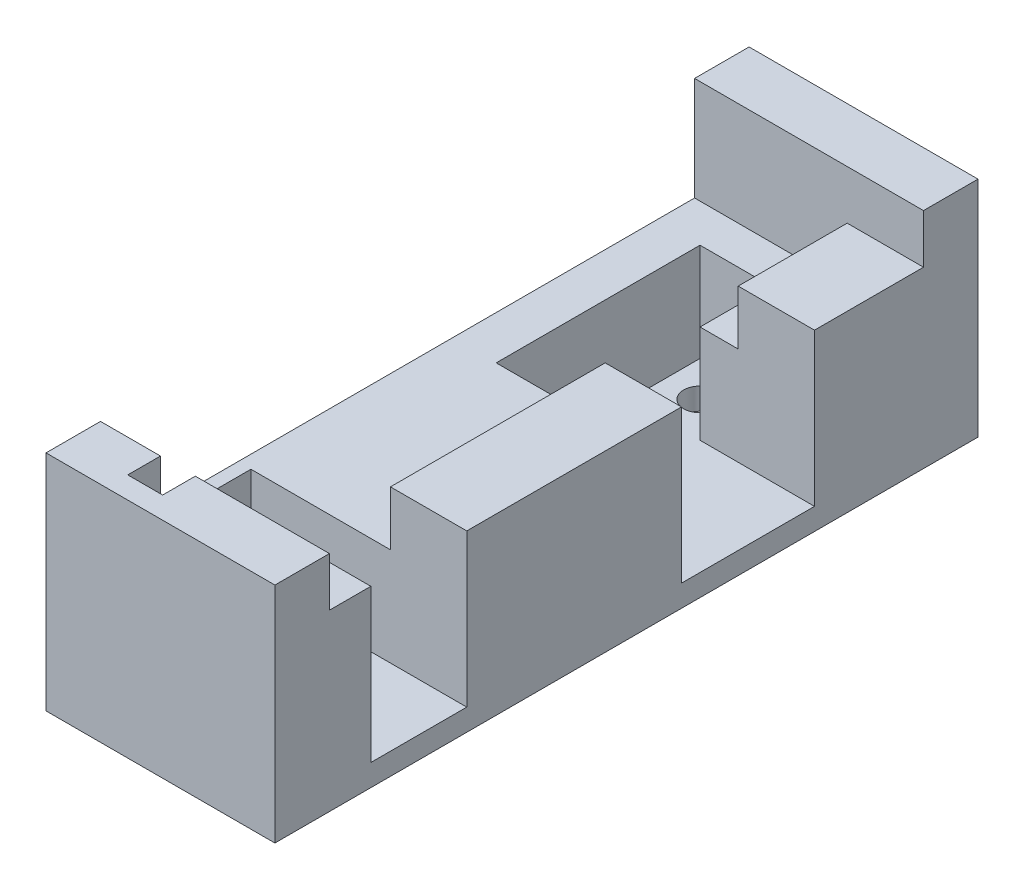
ISO-10303-21;
HEADER;
FILE_DESCRIPTION(('STEP AP214'),'2;1');
FILE_NAME('part.step','',(''),(''),'','','');
FILE_SCHEMA(('AUTOMOTIVE_DESIGN { 1 0 10303 214 1 1 1 1 }'));
ENDSEC;
DATA;
#1=APPLICATION_CONTEXT('core data for automotive mechanical design processes');
#2=APPLICATION_PROTOCOL_DEFINITION('international standard','automotive_design',2000,#1);
#3=PRODUCT_CONTEXT('',#1,'mechanical');
#4=PRODUCT('Part','Part','',(#3));
#5=PRODUCT_RELATED_PRODUCT_CATEGORY('part','',(#4));
#6=PRODUCT_DEFINITION_FORMATION('','',#4);
#7=PRODUCT_DEFINITION_CONTEXT('part definition',#1,'design');
#8=PRODUCT_DEFINITION('design','',#6,#7);
#9=PRODUCT_DEFINITION_SHAPE('','',#8);
#10=(LENGTH_UNIT() NAMED_UNIT(*) SI_UNIT(.MILLI.,.METRE.));
#11=(NAMED_UNIT(*) PLANE_ANGLE_UNIT() SI_UNIT($,.RADIAN.));
#12=(NAMED_UNIT(*) SI_UNIT($,.STERADIAN.) SOLID_ANGLE_UNIT());
#13=UNCERTAINTY_MEASURE_WITH_UNIT(LENGTH_MEASURE(1.E-05),#10,'distance_accuracy_value','');
#14=(GEOMETRIC_REPRESENTATION_CONTEXT(3) GLOBAL_UNCERTAINTY_ASSIGNED_CONTEXT((#13)) GLOBAL_UNIT_ASSIGNED_CONTEXT((#10,
#11,#12)) REPRESENTATION_CONTEXT('',''));
#15=CARTESIAN_POINT('',(0.,0.,0.));
#16=DIRECTION('',(0.,0.,1.));
#17=DIRECTION('',(1.,0.,0.));
#18=AXIS2_PLACEMENT_3D('',#15,#16,#17);
#19=CARTESIAN_POINT('',(-12.3,0.,59.5));
#20=DIRECTION('',(-1.,0.,0.));
#21=DIRECTION('',(0.,0.,1.));
#22=AXIS2_PLACEMENT_3D('',#19,#20,#21);
#23=PLANE('',#22);
#24=DIRECTION('',(0.,0.,-1.));
#25=VECTOR('',#24,1.);
#26=CARTESIAN_POINT('',(-12.3,14.,59.5));
#27=LINE('',#26,#25);
#28=CARTESIAN_POINT('',(-12.3,14.,57.5));
#29=VERTEX_POINT('',#28);
#30=CARTESIAN_POINT('',(-12.3,14.,54.5));
#31=VERTEX_POINT('',#30);
#32=EDGE_CURVE('E253',#29,#31,#27,.T.);
#33=ORIENTED_EDGE('',*,*,#32,.F.);
#34=DIRECTION('',(0.,-1.,0.));
#35=VECTOR('',#34,1.);
#36=CARTESIAN_POINT('',(-12.3,18.5,57.5));
#37=LINE('',#36,#35);
#38=CARTESIAN_POINT('',(-12.3,18.5,57.5));
#39=VERTEX_POINT('',#38);
#40=EDGE_CURVE('E504',#39,#29,#37,.T.);
#41=ORIENTED_EDGE('',*,*,#40,.F.);
#42=DIRECTION('',(0.,0.,-1.));
#43=VECTOR('',#42,1.);
#44=CARTESIAN_POINT('',(-12.3,18.5,59.5));
#45=LINE('',#44,#43);
#46=CARTESIAN_POINT('',(-12.3,18.5,54.5));
#47=VERTEX_POINT('',#46);
#48=EDGE_CURVE('E240',#39,#47,#45,.T.);
#49=ORIENTED_EDGE('',*,*,#48,.T.);
#50=DIRECTION('',(0.,1.,0.));
#51=VECTOR('',#50,1.);
#52=CARTESIAN_POINT('',(-12.3,0.,54.5));
#53=LINE('',#52,#51);
#54=EDGE_CURVE('E537',#31,#47,#53,.T.);
#55=ORIENTED_EDGE('',*,*,#54,.F.);
#56=EDGE_LOOP('',(#33,#41,#49,#55));
#57=FACE_BOUND('',#56,.T.);
#58=ADVANCED_FACE('F41',(#57),#23,.T.);
#59=CARTESIAN_POINT('',(0.,14.,59.5));
#60=DIRECTION('',(0.,-1.,0.));
#61=DIRECTION('',(0.,0.,-1.));
#62=AXIS2_PLACEMENT_3D('',#59,#60,#61);
#63=PLANE('',#62);
#64=DIRECTION('',(1.,0.,0.));
#65=VECTOR('',#64,1.);
#66=CARTESIAN_POINT('',(-21.002,14.,57.5));
#67=LINE('',#66,#65);
#68=CARTESIAN_POINT('',(-15.5,14.,57.5));
#69=VERTEX_POINT('',#68);
#70=EDGE_CURVE('E228',#69,#29,#67,.T.);
#71=ORIENTED_EDGE('',*,*,#70,.T.);
#72=ORIENTED_EDGE('',*,*,#32,.T.);
#73=DIRECTION('',(-1.,0.,0.));
#74=VECTOR('',#73,1.);
#75=CARTESIAN_POINT('',(0.,14.,54.5));
#76=LINE('',#75,#74);
#77=CARTESIAN_POINT('',(-15.5,14.,54.5));
#78=VERTEX_POINT('',#77);
#79=EDGE_CURVE('E542',#31,#78,#76,.T.);
#80=ORIENTED_EDGE('',*,*,#79,.T.);
#81=DIRECTION('',(0.,0.,-1.));
#82=VECTOR('',#81,1.);
#83=CARTESIAN_POINT('',(-15.5,14.,59.5));
#84=LINE('',#83,#82);
#85=EDGE_CURVE('E248',#69,#78,#84,.T.);
#86=ORIENTED_EDGE('',*,*,#85,.F.);
#87=EDGE_LOOP('',(#71,#72,#80,#86));
#88=FACE_BOUND('',#87,.T.);
#89=ADVANCED_FACE('F624',(#88),#63,.F.);
#90=CARTESIAN_POINT('',(-15.5,0.,59.5));
#91=DIRECTION('',(-1.,0.,0.));
#92=DIRECTION('',(0.,0.,1.));
#93=AXIS2_PLACEMENT_3D('',#90,#91,#92);
#94=PLANE('',#93);
#95=DIRECTION('',(0.,-1.,0.));
#96=VECTOR('',#95,1.);
#97=CARTESIAN_POINT('',(-15.5,18.5,57.5));
#98=LINE('',#97,#96);
#99=CARTESIAN_POINT('',(-15.5,18.5,57.5));
#100=VERTEX_POINT('',#99);
#101=EDGE_CURVE('E222',#100,#69,#98,.T.);
#102=ORIENTED_EDGE('',*,*,#101,.T.);
#103=ORIENTED_EDGE('',*,*,#85,.T.);
#104=DIRECTION('',(0.,1.,0.));
#105=VECTOR('',#104,1.);
#106=CARTESIAN_POINT('',(-15.5,0.,54.5));
#107=LINE('',#106,#105);
#108=CARTESIAN_POINT('',(-15.5,18.5,54.5));
#109=VERTEX_POINT('',#108);
#110=EDGE_CURVE('E245',#78,#109,#107,.T.);
#111=ORIENTED_EDGE('',*,*,#110,.T.);
#112=DIRECTION('',(0.,0.,-1.));
#113=VECTOR('',#112,1.);
#114=CARTESIAN_POINT('',(-15.5,18.5,59.5));
#115=LINE('',#114,#113);
#116=EDGE_CURVE('E238',#100,#109,#115,.T.);
#117=ORIENTED_EDGE('',*,*,#116,.F.);
#118=EDGE_LOOP('',(#102,#103,#111,#117));
#119=FACE_BOUND('',#118,.T.);
#120=ADVANCED_FACE('F243',(#119),#94,.F.);
#121=CARTESIAN_POINT('',(-21.,14.,0.));
#122=DIRECTION('',(1.,0.,0.));
#123=DIRECTION('',(0.,0.,-1.));
#124=AXIS2_PLACEMENT_3D('',#121,#122,#123);
#125=PLANE('',#124);
#126=DIRECTION('',(0.,0.,1.));
#127=VECTOR('',#126,1.);
#128=CARTESIAN_POINT('',(-21.,9.,0.));
#129=LINE('',#128,#127);
#130=CARTESIAN_POINT('',(-21.,9.,0.));
#131=VERTEX_POINT('',#130);
#132=CARTESIAN_POINT('',(-21.,9.,54.5));
#133=VERTEX_POINT('',#132);
#134=EDGE_CURVE('E269',#131,#133,#129,.T.);
#135=ORIENTED_EDGE('',*,*,#134,.F.);
#136=DIRECTION('',(0.,1.,0.));
#137=VECTOR('',#136,1.);
#138=CARTESIAN_POINT('',(-21.,-2.,0.));
#139=LINE('',#138,#137);
#140=CARTESIAN_POINT('',(-21.,18.5,0.));
#141=VERTEX_POINT('',#140);
#142=EDGE_CURVE('E492',#131,#141,#139,.T.);
#143=ORIENTED_EDGE('',*,*,#142,.T.);
#144=DIRECTION('',(0.,0.,1.));
#145=VECTOR('',#144,1.);
#146=CARTESIAN_POINT('',(-21.,18.5,-5.));
#147=LINE('',#146,#145);
#148=CARTESIAN_POINT('',(-21.,18.5,-5.));
#149=VERTEX_POINT('',#148);
#150=EDGE_CURVE('E512',#149,#141,#147,.T.);
#151=ORIENTED_EDGE('',*,*,#150,.F.);
#152=DIRECTION('',(0.,1.,0.));
#153=VECTOR('',#152,1.);
#154=CARTESIAN_POINT('',(-21.,-2.,-5.));
#155=LINE('',#154,#153);
#156=CARTESIAN_POINT('',(-21.,-2.,-5.));
#157=VERTEX_POINT('',#156);
#158=EDGE_CURVE('E593',#157,#149,#155,.T.);
#159=ORIENTED_EDGE('',*,*,#158,.F.);
#160=DIRECTION('',(0.,0.,1.));
#161=VECTOR('',#160,1.);
#162=CARTESIAN_POINT('',(-21.,-2.,0.));
#163=LINE('',#162,#161);
#164=CARTESIAN_POINT('',(-21.,-2.,59.5));
#165=VERTEX_POINT('',#164);
#166=EDGE_CURVE('E342',#157,#165,#163,.T.);
#167=ORIENTED_EDGE('',*,*,#166,.T.);
#168=DIRECTION('',(0.,-1.,0.));
#169=VECTOR('',#168,1.);
#170=CARTESIAN_POINT('',(-21.,0.,59.5));
#171=LINE('',#170,#169);
#172=CARTESIAN_POINT('',(-21.,18.5,59.5));
#173=VERTEX_POINT('',#172);
#174=EDGE_CURVE('E525',#173,#165,#171,.T.);
#175=ORIENTED_EDGE('',*,*,#174,.F.);
#176=DIRECTION('',(0.,0.,-1.));
#177=VECTOR('',#176,1.);
#178=CARTESIAN_POINT('',(-21.,18.5,59.5));
#179=LINE('',#178,#177);
#180=CARTESIAN_POINT('',(-21.,18.5,54.5));
#181=VERTEX_POINT('',#180);
#182=EDGE_CURVE('E249',#173,#181,#179,.T.);
#183=ORIENTED_EDGE('',*,*,#182,.T.);
#184=DIRECTION('',(0.,-1.,0.));
#185=VECTOR('',#184,1.);
#186=CARTESIAN_POINT('',(-21.,0.,54.5));
#187=LINE('',#186,#185);
#188=EDGE_CURVE('E522',#181,#133,#187,.T.);
#189=ORIENTED_EDGE('',*,*,#188,.T.);
#190=EDGE_LOOP('',(#135,#143,#151,#159,#167,#175,#183,#189));
#191=FACE_BOUND('',#190,.T.);
#192=ADVANCED_FACE('F43',(#191),#125,.F.);
#193=CARTESIAN_POINT('',(-19.8,14.,41.9));
#194=DIRECTION('',(-1.,0.,0.));
#195=DIRECTION('',(0.,0.,1.));
#196=AXIS2_PLACEMENT_3D('',#193,#194,#195);
#197=PLANE('',#196);
#198=DIRECTION('',(0.,0.,-1.));
#199=VECTOR('',#198,1.);
#200=CARTESIAN_POINT('',(-19.8,9.,41.9));
#201=LINE('',#200,#199);
#202=CARTESIAN_POINT('',(-19.8,9.,50.7));
#203=VERTEX_POINT('',#202);
#204=CARTESIAN_POINT('',(-19.8,9.,41.9));
#205=VERTEX_POINT('',#204);
#206=EDGE_CURVE('E327',#203,#205,#201,.T.);
#207=ORIENTED_EDGE('',*,*,#206,.F.);
#208=DIRECTION('',(0.,-1.,0.));
#209=VECTOR('',#208,1.);
#210=CARTESIAN_POINT('',(-19.8,14.,50.7));
#211=LINE('',#210,#209);
#212=CARTESIAN_POINT('',(-19.8,0.,50.7));
#213=VERTEX_POINT('',#212);
#214=EDGE_CURVE('E440',#203,#213,#211,.T.);
#215=ORIENTED_EDGE('',*,*,#214,.T.);
#216=DIRECTION('',(0.,0.,-1.));
#217=VECTOR('',#216,1.);
#218=CARTESIAN_POINT('',(-19.8,0.,41.9));
#219=LINE('',#218,#217);
#220=CARTESIAN_POINT('',(-19.8,0.,41.9));
#221=VERTEX_POINT('',#220);
#222=EDGE_CURVE('E387',#213,#221,#219,.T.);
#223=ORIENTED_EDGE('',*,*,#222,.T.);
#224=DIRECTION('',(0.,-1.,0.));
#225=VECTOR('',#224,1.);
#226=CARTESIAN_POINT('',(-19.8,14.,41.9));
#227=LINE('',#226,#225);
#228=EDGE_CURVE('E437',#205,#221,#227,.T.);
#229=ORIENTED_EDGE('',*,*,#228,.F.);
#230=EDGE_LOOP('',(#207,#215,#223,#229));
#231=FACE_BOUND('',#230,.T.);
#232=ADVANCED_FACE('F565',(#231),#197,.F.);
#233=CARTESIAN_POINT('',(-17.,14.,10.));
#234=DIRECTION('',(-1.,0.,0.));
#235=DIRECTION('',(0.,0.,1.));
#236=AXIS2_PLACEMENT_3D('',#233,#234,#235);
#237=PLANE('',#236);
#238=DIRECTION('',(0.,0.,-1.));
#239=VECTOR('',#238,1.);
#240=CARTESIAN_POINT('',(-17.,9.,10.));
#241=LINE('',#240,#239);
#242=CARTESIAN_POINT('',(-17.,9.,22.2));
#243=VERTEX_POINT('',#242);
#244=CARTESIAN_POINT('',(-17.,9.,3.5));
#245=VERTEX_POINT('',#244);
#246=EDGE_CURVE('E318',#243,#245,#241,.T.);
#247=ORIENTED_EDGE('',*,*,#246,.F.);
#248=DIRECTION('',(0.,-1.,0.));
#249=VECTOR('',#248,1.);
#250=CARTESIAN_POINT('',(-17.,14.,22.2));
#251=LINE('',#250,#249);
#252=CARTESIAN_POINT('',(-17.,0.,22.2));
#253=VERTEX_POINT('',#252);
#254=EDGE_CURVE('E426',#243,#253,#251,.T.);
#255=ORIENTED_EDGE('',*,*,#254,.T.);
#256=DIRECTION('',(0.,0.,-1.));
#257=VECTOR('',#256,1.);
#258=CARTESIAN_POINT('',(-17.,0.,10.));
#259=LINE('',#258,#257);
#260=CARTESIAN_POINT('',(-17.,0.,3.5));
#261=VERTEX_POINT('',#260);
#262=EDGE_CURVE('E399',#253,#261,#259,.T.);
#263=ORIENTED_EDGE('',*,*,#262,.T.);
#264=DIRECTION('',(0.,-1.,0.));
#265=VECTOR('',#264,1.);
#266=CARTESIAN_POINT('',(-17.,14.,3.5));
#267=LINE('',#266,#265);
#268=EDGE_CURVE('E423',#245,#261,#267,.T.);
#269=ORIENTED_EDGE('',*,*,#268,.F.);
#270=EDGE_LOOP('',(#247,#255,#263,#269));
#271=FACE_BOUND('',#270,.T.);
#272=ADVANCED_FACE('F665',(#271),#237,.F.);
#273=CARTESIAN_POINT('',(-17.,14.,3.5));
#274=DIRECTION('',(0.,0.,-1.));
#275=DIRECTION('',(-1.,0.,0.));
#276=AXIS2_PLACEMENT_3D('',#273,#274,#275);
#277=PLANE('',#276);
#278=DIRECTION('',(1.,0.,0.));
#279=VECTOR('',#278,1.);
#280=CARTESIAN_POINT('',(-17.,9.,3.5));
#281=LINE('',#280,#279);
#282=CARTESIAN_POINT('',(-10.5,9.,3.5));
#283=VERTEX_POINT('',#282);
#284=EDGE_CURVE('E315',#245,#283,#281,.T.);
#285=ORIENTED_EDGE('',*,*,#284,.F.);
#286=ORIENTED_EDGE('',*,*,#268,.T.);
#287=DIRECTION('',(1.,0.,0.));
#288=VECTOR('',#287,1.);
#289=CARTESIAN_POINT('',(-17.,0.,3.5));
#290=LINE('',#289,#288);
#291=CARTESIAN_POINT('',(-10.5,0.,3.5));
#292=VERTEX_POINT('',#291);
#293=EDGE_CURVE('E403',#261,#292,#290,.T.);
#294=ORIENTED_EDGE('',*,*,#293,.T.);
#295=DIRECTION('',(0.,-1.,0.));
#296=VECTOR('',#295,1.);
#297=CARTESIAN_POINT('',(-10.5,14.,3.5));
#298=LINE('',#297,#296);
#299=EDGE_CURVE('E420',#283,#292,#298,.T.);
#300=ORIENTED_EDGE('',*,*,#299,.F.);
#301=EDGE_LOOP('',(#285,#286,#294,#300));
#302=FACE_BOUND('',#301,.T.);
#303=ADVANCED_FACE('F615',(#302),#277,.F.);
#304=CARTESIAN_POINT('',(-10.5,14.,3.5));
#305=DIRECTION('',(1.,0.,0.));
#306=DIRECTION('',(0.,0.,-1.));
#307=AXIS2_PLACEMENT_3D('',#304,#305,#306);
#308=PLANE('',#307);
#309=DIRECTION('',(0.,0.,1.));
#310=VECTOR('',#309,1.);
#311=CARTESIAN_POINT('',(-10.5,9.,3.5));
#312=LINE('',#311,#310);
#313=CARTESIAN_POINT('',(-10.5,9.,10.));
#314=VERTEX_POINT('',#313);
#315=EDGE_CURVE('E312',#283,#314,#312,.T.);
#316=ORIENTED_EDGE('',*,*,#315,.F.);
#317=ORIENTED_EDGE('',*,*,#299,.T.);
#318=DIRECTION('',(0.,0.,1.));
#319=VECTOR('',#318,1.);
#320=CARTESIAN_POINT('',(-10.5,0.,3.5));
#321=LINE('',#320,#319);
#322=CARTESIAN_POINT('',(-10.5,0.,10.));
#323=VERTEX_POINT('',#322);
#324=EDGE_CURVE('E407',#292,#323,#321,.T.);
#325=ORIENTED_EDGE('',*,*,#324,.T.);
#326=DIRECTION('',(0.,-1.,0.));
#327=VECTOR('',#326,1.);
#328=CARTESIAN_POINT('',(-10.5,14.,10.));
#329=LINE('',#328,#327);
#330=EDGE_CURVE('E417',#314,#323,#329,.T.);
#331=ORIENTED_EDGE('',*,*,#330,.F.);
#332=EDGE_LOOP('',(#316,#317,#325,#331));
#333=FACE_BOUND('',#332,.T.);
#334=ADVANCED_FACE('F609',(#333),#308,.F.);
#335=CARTESIAN_POINT('',(0.,14.,0.));
#336=DIRECTION('',(0.,-1.,0.));
#337=DIRECTION('',(0.,0.,-1.));
#338=AXIS2_PLACEMENT_3D('',#335,#336,#337);
#339=PLANE('',#338);
#340=DIRECTION('',(-1.,0.,0.));
#341=VECTOR('',#340,1.);
#342=CARTESIAN_POINT('',(0.,14.,0.));
#343=LINE('',#342,#341);
#344=CARTESIAN_POINT('',(0.,14.,0.));
#345=VERTEX_POINT('',#344);
#346=CARTESIAN_POINT('',(-7.,14.,0.));
#347=VERTEX_POINT('',#346);
#348=EDGE_CURVE('E355',#345,#347,#343,.T.);
#349=ORIENTED_EDGE('',*,*,#348,.T.);
#350=DIRECTION('',(0.,0.,1.));
#351=VECTOR('',#350,1.);
#352=CARTESIAN_POINT('',(-7.,14.,0.));
#353=LINE('',#352,#351);
#354=CARTESIAN_POINT('',(-7.,14.,10.));
#355=VERTEX_POINT('',#354);
#356=EDGE_CURVE('E51',#347,#355,#353,.T.);
#357=ORIENTED_EDGE('',*,*,#356,.T.);
#358=DIRECTION('',(1.,0.,0.));
#359=VECTOR('',#358,1.);
#360=CARTESIAN_POINT('',(0.,14.,10.));
#361=LINE('',#360,#359);
#362=CARTESIAN_POINT('',(0.,14.,10.));
#363=VERTEX_POINT('',#362);
#364=EDGE_CURVE('E58',#355,#363,#361,.T.);
#365=ORIENTED_EDGE('',*,*,#364,.T.);
#366=DIRECTION('',(0.,0.,-1.));
#367=VECTOR('',#366,1.);
#368=CARTESIAN_POINT('',(0.,14.,0.));
#369=LINE('',#368,#367);
#370=EDGE_CURVE('E352',#363,#345,#369,.T.);
#371=ORIENTED_EDGE('',*,*,#370,.T.);
#372=EDGE_LOOP('',(#349,#357,#365,#371));
#373=FACE_BOUND('',#372,.T.);
#374=ADVANCED_FACE('F607',(#373),#339,.F.);
#375=DIRECTION('',(-1.,0.,0.));
#376=VECTOR('',#375,1.);
#377=CARTESIAN_POINT('',(-17.,14.,22.2));
#378=LINE('',#377,#376);
#379=CARTESIAN_POINT('',(0.,14.,22.2));
#380=VERTEX_POINT('',#379);
#381=CARTESIAN_POINT('',(-7.,14.,22.2));
#382=VERTEX_POINT('',#381);
#383=EDGE_CURVE('E377',#380,#382,#378,.T.);
#384=ORIENTED_EDGE('',*,*,#383,.T.);
#385=CARTESIAN_POINT('',(-6.99999999999999,14.,41.9));
#386=VERTEX_POINT('',#385);
#387=EDGE_CURVE('E447',#382,#386,#353,.T.);
#388=ORIENTED_EDGE('',*,*,#387,.T.);
#389=DIRECTION('',(1.,0.,0.));
#390=VECTOR('',#389,1.);
#391=CARTESIAN_POINT('',(-5.8,14.,41.9));
#392=LINE('',#391,#390);
#393=CARTESIAN_POINT('',(0.,14.,41.9));
#394=VERTEX_POINT('',#393);
#395=EDGE_CURVE('E371',#386,#394,#392,.T.);
#396=ORIENTED_EDGE('',*,*,#395,.T.);
#397=DIRECTION('',(0.,0.,-1.));
#398=VECTOR('',#397,1.);
#399=CARTESIAN_POINT('',(0.,14.,22.2));
#400=LINE('',#399,#398);
#401=EDGE_CURVE('E374',#394,#380,#400,.T.);
#402=ORIENTED_EDGE('',*,*,#401,.T.);
#403=EDGE_LOOP('',(#384,#388,#396,#402));
#404=FACE_BOUND('',#403,.T.);
#405=ADVANCED_FACE('F454',(#404),#339,.F.);
#406=CARTESIAN_POINT('',(-19.8,14.,50.7));
#407=DIRECTION('',(0.,0.,1.));
#408=DIRECTION('',(1.,0.,0.));
#409=AXIS2_PLACEMENT_3D('',#406,#407,#408);
#410=PLANE('',#409);
#411=DIRECTION('',(-1.,0.,0.));
#412=VECTOR('',#411,1.);
#413=CARTESIAN_POINT('',(-19.8,9.,50.7));
#414=LINE('',#413,#412);
#415=CARTESIAN_POINT('',(-6.99999999999999,9.,50.7));
#416=VERTEX_POINT('',#415);
#417=EDGE_CURVE('E330',#416,#203,#414,.T.);
#418=ORIENTED_EDGE('',*,*,#417,.F.);
#419=DIRECTION('',(0.,1.,0.));
#420=VECTOR('',#419,1.);
#421=CARTESIAN_POINT('',(-6.99999999999999,14.,50.7));
#422=LINE('',#421,#420);
#423=CARTESIAN_POINT('',(-6.99999999999999,14.,50.7));
#424=VERTEX_POINT('',#423);
#425=EDGE_CURVE('E308',#416,#424,#422,.T.);
#426=ORIENTED_EDGE('',*,*,#425,.T.);
#427=DIRECTION('',(-1.,0.,0.));
#428=VECTOR('',#427,1.);
#429=CARTESIAN_POINT('',(-5.8,14.,50.7));
#430=LINE('',#429,#428);
#431=CARTESIAN_POINT('',(0.,14.,50.7));
#432=VERTEX_POINT('',#431);
#433=EDGE_CURVE('E367',#432,#424,#430,.T.);
#434=ORIENTED_EDGE('',*,*,#433,.F.);
#435=DIRECTION('',(0.,-1.,0.));
#436=VECTOR('',#435,1.);
#437=CARTESIAN_POINT('',(0.,14.,50.7));
#438=LINE('',#437,#436);
#439=CARTESIAN_POINT('',(0.,0.,50.7));
#440=VERTEX_POINT('',#439);
#441=EDGE_CURVE('E444',#432,#440,#438,.T.);
#442=ORIENTED_EDGE('',*,*,#441,.T.);
#443=DIRECTION('',(-1.,0.,0.));
#444=VECTOR('',#443,1.);
#445=CARTESIAN_POINT('',(-19.8,0.,50.7));
#446=LINE('',#445,#444);
#447=EDGE_CURVE('E349',#440,#213,#446,.T.);
#448=ORIENTED_EDGE('',*,*,#447,.T.);
#449=ORIENTED_EDGE('',*,*,#214,.F.);
#450=EDGE_LOOP('',(#418,#426,#434,#442,#448,#449));
#451=FACE_BOUND('',#450,.T.);
#452=ADVANCED_FACE('F561',(#451),#410,.F.);
#453=CARTESIAN_POINT('',(0.,14.,41.9));
#454=DIRECTION('',(0.,0.,-1.));
#455=DIRECTION('',(-1.,0.,0.));
#456=AXIS2_PLACEMENT_3D('',#453,#454,#455);
#457=PLANE('',#456);
#458=ORIENTED_EDGE('',*,*,#395,.F.);
#459=DIRECTION('',(0.,-1.,0.));
#460=VECTOR('',#459,1.);
#461=CARTESIAN_POINT('',(-6.99999999999999,14.,41.9));
#462=LINE('',#461,#460);
#463=CARTESIAN_POINT('',(-6.99999999999999,9.,41.9));
#464=VERTEX_POINT('',#463);
#465=EDGE_CURVE('E304',#386,#464,#462,.T.);
#466=ORIENTED_EDGE('',*,*,#465,.T.);
#467=DIRECTION('',(1.,0.,0.));
#468=VECTOR('',#467,1.);
#469=CARTESIAN_POINT('',(0.,9.,41.9));
#470=LINE('',#469,#468);
#471=EDGE_CURVE('E324',#205,#464,#470,.T.);
#472=ORIENTED_EDGE('',*,*,#471,.F.);
#473=ORIENTED_EDGE('',*,*,#228,.T.);
#474=DIRECTION('',(1.,0.,0.));
#475=VECTOR('',#474,1.);
#476=CARTESIAN_POINT('',(0.,0.,41.9));
#477=LINE('',#476,#475);
#478=CARTESIAN_POINT('',(0.,0.,41.9));
#479=VERTEX_POINT('',#478);
#480=EDGE_CURVE('E391',#221,#479,#477,.T.);
#481=ORIENTED_EDGE('',*,*,#480,.T.);
#482=DIRECTION('',(0.,-1.,0.));
#483=VECTOR('',#482,1.);
#484=CARTESIAN_POINT('',(0.,14.,41.9));
#485=LINE('',#484,#483);
#486=EDGE_CURVE('E433',#394,#479,#485,.T.);
#487=ORIENTED_EDGE('',*,*,#486,.F.);
#488=EDGE_LOOP('',(#458,#466,#472,#473,#481,#487));
#489=FACE_BOUND('',#488,.T.);
#490=ADVANCED_FACE('F459',(#489),#457,.F.);
#491=CARTESIAN_POINT('',(0.,14.,22.2));
#492=DIRECTION('',(-1.,0.,0.));
#493=DIRECTION('',(0.,0.,1.));
#494=AXIS2_PLACEMENT_3D('',#491,#492,#493);
#495=PLANE('',#494);
#496=ORIENTED_EDGE('',*,*,#486,.T.);
#497=DIRECTION('',(0.,0.,-1.));
#498=VECTOR('',#497,1.);
#499=CARTESIAN_POINT('',(0.,0.,0.));
#500=LINE('',#499,#498);
#501=EDGE_CURVE('E346',#440,#479,#500,.T.);
#502=ORIENTED_EDGE('',*,*,#501,.F.);
#503=ORIENTED_EDGE('',*,*,#441,.F.);
#504=DIRECTION('',(0.,0.,-1.));
#505=VECTOR('',#504,1.);
#506=CARTESIAN_POINT('',(0.,14.,50.7));
#507=LINE('',#506,#505);
#508=CARTESIAN_POINT('',(0.,14.,54.5));
#509=VERTEX_POINT('',#508);
#510=EDGE_CURVE('E364',#509,#432,#507,.T.);
#511=ORIENTED_EDGE('',*,*,#510,.F.);
#512=DIRECTION('',(0.,1.,0.));
#513=VECTOR('',#512,1.);
#514=CARTESIAN_POINT('',(0.,0.,54.5));
#515=LINE('',#514,#513);
#516=CARTESIAN_POINT('',(0.,18.5,54.5));
#517=VERTEX_POINT('',#516);
#518=EDGE_CURVE('E516',#509,#517,#515,.T.);
#519=ORIENTED_EDGE('',*,*,#518,.T.);
#520=DIRECTION('',(0.,0.,-1.));
#521=VECTOR('',#520,1.);
#522=CARTESIAN_POINT('',(0.,18.5,59.5));
#523=LINE('',#522,#521);
#524=CARTESIAN_POINT('',(0.,18.5,59.5));
#525=VERTEX_POINT('',#524);
#526=EDGE_CURVE('E264',#525,#517,#523,.T.);
#527=ORIENTED_EDGE('',*,*,#526,.F.);
#528=DIRECTION('',(0.,1.,0.));
#529=VECTOR('',#528,1.);
#530=CARTESIAN_POINT('',(0.,0.,59.5));
#531=LINE('',#530,#529);
#532=CARTESIAN_POINT('',(0.,-2.,59.5));
#533=VERTEX_POINT('',#532);
#534=EDGE_CURVE('E517',#533,#525,#531,.T.);
#535=ORIENTED_EDGE('',*,*,#534,.F.);
#536=DIRECTION('',(0.,0.,-1.));
#537=VECTOR('',#536,1.);
#538=CARTESIAN_POINT('',(0.,-2.,0.));
#539=LINE('',#538,#537);
#540=CARTESIAN_POINT('',(0.,-2.,-5.));
#541=VERTEX_POINT('',#540);
#542=EDGE_CURVE('E345',#533,#541,#539,.T.);
#543=ORIENTED_EDGE('',*,*,#542,.T.);
#544=DIRECTION('',(0.,-1.,0.));
#545=VECTOR('',#544,1.);
#546=CARTESIAN_POINT('',(0.,18.5,-5.));
#547=LINE('',#546,#545);
#548=CARTESIAN_POINT('',(0.,18.5,-5.));
#549=VERTEX_POINT('',#548);
#550=EDGE_CURVE('E502',#549,#541,#547,.T.);
#551=ORIENTED_EDGE('',*,*,#550,.F.);
#552=DIRECTION('',(0.,0.,1.));
#553=VECTOR('',#552,1.);
#554=CARTESIAN_POINT('',(0.,18.5,-5.));
#555=LINE('',#554,#553);
#556=CARTESIAN_POINT('',(0.,18.5,0.));
#557=VERTEX_POINT('',#556);
#558=EDGE_CURVE('E508',#549,#557,#555,.T.);
#559=ORIENTED_EDGE('',*,*,#558,.T.);
#560=DIRECTION('',(0.,-1.,0.));
#561=VECTOR('',#560,1.);
#562=CARTESIAN_POINT('',(0.,18.5,0.));
#563=LINE('',#562,#561);
#564=EDGE_CURVE('E498',#557,#345,#563,.T.);
#565=ORIENTED_EDGE('',*,*,#564,.T.);
#566=ORIENTED_EDGE('',*,*,#370,.F.);
#567=DIRECTION('',(0.,-1.,0.));
#568=VECTOR('',#567,1.);
#569=CARTESIAN_POINT('',(0.,14.,10.));
#570=LINE('',#569,#568);
#571=CARTESIAN_POINT('',(0.,0.,10.));
#572=VERTEX_POINT('',#571);
#573=EDGE_CURVE('E383',#363,#572,#570,.T.);
#574=ORIENTED_EDGE('',*,*,#573,.T.);
#575=CARTESIAN_POINT('',(0.,0.,22.2));
#576=VERTEX_POINT('',#575);
#577=EDGE_CURVE('E338',#576,#572,#500,.T.);
#578=ORIENTED_EDGE('',*,*,#577,.F.);
#579=DIRECTION('',(0.,-1.,0.));
#580=VECTOR('',#579,1.);
#581=CARTESIAN_POINT('',(0.,14.,22.2));
#582=LINE('',#581,#580);
#583=EDGE_CURVE('E429',#380,#576,#582,.T.);
#584=ORIENTED_EDGE('',*,*,#583,.F.);
#585=ORIENTED_EDGE('',*,*,#401,.F.);
#586=EDGE_LOOP('',(#496,#502,#503,#511,#519,#527,#535,#543,#551,#559,#565,#566,#574,#578,#584,#585));
#587=FACE_BOUND('',#586,.T.);
#588=ADVANCED_FACE('F466',(#587),#495,.F.);
#589=CARTESIAN_POINT('',(-17.,14.,22.2));
#590=DIRECTION('',(0.,0.,1.));
#591=DIRECTION('',(1.,0.,0.));
#592=AXIS2_PLACEMENT_3D('',#589,#590,#591);
#593=PLANE('',#592);
#594=DIRECTION('',(-1.,0.,0.));
#595=VECTOR('',#594,1.);
#596=CARTESIAN_POINT('',(-17.,9.,22.2));
#597=LINE('',#596,#595);
#598=CARTESIAN_POINT('',(-7.,9.,22.2));
#599=VERTEX_POINT('',#598);
#600=EDGE_CURVE('E321',#599,#243,#597,.T.);
#601=ORIENTED_EDGE('',*,*,#600,.F.);
#602=DIRECTION('',(0.,1.,0.));
#603=VECTOR('',#602,1.);
#604=CARTESIAN_POINT('',(-7.,14.,22.2));
#605=LINE('',#604,#603);
#606=EDGE_CURVE('E300',#599,#382,#605,.T.);
#607=ORIENTED_EDGE('',*,*,#606,.T.);
#608=ORIENTED_EDGE('',*,*,#383,.F.);
#609=ORIENTED_EDGE('',*,*,#583,.T.);
#610=DIRECTION('',(-1.,0.,0.));
#611=VECTOR('',#610,1.);
#612=CARTESIAN_POINT('',(-17.,0.,22.2));
#613=LINE('',#612,#611);
#614=EDGE_CURVE('E395',#576,#253,#613,.T.);
#615=ORIENTED_EDGE('',*,*,#614,.T.);
#616=ORIENTED_EDGE('',*,*,#254,.F.);
#617=EDGE_LOOP('',(#601,#607,#608,#609,#615,#616));
#618=FACE_BOUND('',#617,.T.);
#619=ADVANCED_FACE('F470',(#618),#593,.F.);
#620=CARTESIAN_POINT('',(0.,14.,10.));
#621=DIRECTION('',(0.,0.,-1.));
#622=DIRECTION('',(-1.,0.,0.));
#623=AXIS2_PLACEMENT_3D('',#620,#621,#622);
#624=PLANE('',#623);
#625=ORIENTED_EDGE('',*,*,#364,.F.);
#626=DIRECTION('',(0.,-1.,0.));
#627=VECTOR('',#626,1.);
#628=CARTESIAN_POINT('',(-7.,14.,10.));
#629=LINE('',#628,#627);
#630=CARTESIAN_POINT('',(-7.,9.,10.));
#631=VERTEX_POINT('',#630);
#632=EDGE_CURVE('E293',#355,#631,#629,.T.);
#633=ORIENTED_EDGE('',*,*,#632,.T.);
#634=DIRECTION('',(1.,0.,0.));
#635=VECTOR('',#634,1.);
#636=CARTESIAN_POINT('',(0.,9.,10.));
#637=LINE('',#636,#635);
#638=EDGE_CURVE('E11',#314,#631,#637,.T.);
#639=ORIENTED_EDGE('',*,*,#638,.F.);
#640=ORIENTED_EDGE('',*,*,#330,.T.);
#641=DIRECTION('',(1.,0.,0.));
#642=VECTOR('',#641,1.);
#643=CARTESIAN_POINT('',(0.,0.,10.));
#644=LINE('',#643,#642);
#645=EDGE_CURVE('E356',#323,#572,#644,.T.);
#646=ORIENTED_EDGE('',*,*,#645,.T.);
#647=ORIENTED_EDGE('',*,*,#573,.F.);
#648=EDGE_LOOP('',(#625,#633,#639,#640,#646,#647));
#649=FACE_BOUND('',#648,.T.);
#650=ADVANCED_FACE('F622',(#649),#624,.F.);
#651=ORIENTED_EDGE('',*,*,#433,.T.);
#652=DIRECTION('',(0.,0.,-1.));
#653=VECTOR('',#652,1.);
#654=CARTESIAN_POINT('',(-7.,14.,0.));
#655=LINE('',#654,#653);
#656=CARTESIAN_POINT('',(-6.99999999999999,14.,54.5));
#657=VERTEX_POINT('',#656);
#658=EDGE_CURVE('E268',#657,#424,#655,.T.);
#659=ORIENTED_EDGE('',*,*,#658,.F.);
#660=DIRECTION('',(1.,0.,0.));
#661=VECTOR('',#660,1.);
#662=CARTESIAN_POINT('',(-21.,14.,54.5));
#663=LINE('',#662,#661);
#664=EDGE_CURVE('E360',#657,#509,#663,.T.);
#665=ORIENTED_EDGE('',*,*,#664,.T.);
#666=ORIENTED_EDGE('',*,*,#510,.T.);
#667=EDGE_LOOP('',(#651,#659,#665,#666));
#668=FACE_BOUND('',#667,.T.);
#669=ADVANCED_FACE('F574',(#668),#339,.F.);
#670=CARTESIAN_POINT('',(0.,0.,0.));
#671=DIRECTION('',(0.,1.,0.));
#672=DIRECTION('',(0.,0.,1.));
#673=AXIS2_PLACEMENT_3D('',#670,#671,#672);
#674=PLANE('',#673);
#675=CARTESIAN_POINT('',(-13.75,0.,6.75));
#676=DIRECTION('',(0.,1.,0.));
#677=DIRECTION('',(0.,0.,1.));
#678=AXIS2_PLACEMENT_3D('',#675,#676,#677);
#679=CIRCLE('',#678,1.5);
#680=CARTESIAN_POINT('',(-13.75,0.,8.25));
#681=VERTEX_POINT('',#680);
#682=EDGE_CURVE('E333',#681,#681,#679,.T.);
#683=ORIENTED_EDGE('',*,*,#682,.F.);
#684=EDGE_LOOP('',(#683));
#685=FACE_BOUND('',#684,.T.);
#686=ORIENTED_EDGE('',*,*,#645,.F.);
#687=ORIENTED_EDGE('',*,*,#324,.F.);
#688=ORIENTED_EDGE('',*,*,#293,.F.);
#689=ORIENTED_EDGE('',*,*,#262,.F.);
#690=ORIENTED_EDGE('',*,*,#614,.F.);
#691=ORIENTED_EDGE('',*,*,#577,.T.);
#692=EDGE_LOOP('',(#686,#687,#688,#689,#690,#691));
#693=FACE_BOUND('',#692,.T.);
#694=ADVANCED_FACE('F621',(#685,#693),#674,.T.);
#695=ORIENTED_EDGE('',*,*,#480,.F.);
#696=ORIENTED_EDGE('',*,*,#222,.F.);
#697=ORIENTED_EDGE('',*,*,#447,.F.);
#698=ORIENTED_EDGE('',*,*,#501,.T.);
#699=EDGE_LOOP('',(#695,#696,#697,#698));
#700=FACE_BOUND('',#699,.T.);
#701=ADVANCED_FACE('F568',(#700),#674,.T.);
#702=CARTESIAN_POINT('',(0.,-2.,0.));
#703=DIRECTION('',(0.,1.,0.));
#704=DIRECTION('',(0.,0.,1.));
#705=AXIS2_PLACEMENT_3D('',#702,#703,#704);
#706=PLANE('',#705);
#707=CARTESIAN_POINT('',(-13.75,-2.,6.75));
#708=DIRECTION('',(0.,1.,0.));
#709=DIRECTION('',(0.,0.,1.));
#710=AXIS2_PLACEMENT_3D('',#707,#708,#709);
#711=CIRCLE('',#710,1.5);
#712=CARTESIAN_POINT('',(-13.75,-2.,8.25));
#713=VERTEX_POINT('',#712);
#714=EDGE_CURVE('E334',#713,#713,#711,.T.);
#715=ORIENTED_EDGE('',*,*,#714,.T.);
#716=EDGE_LOOP('',(#715));
#717=FACE_BOUND('',#716,.T.);
#718=ORIENTED_EDGE('',*,*,#166,.F.);
#719=DIRECTION('',(-1.,0.,0.));
#720=VECTOR('',#719,1.);
#721=CARTESIAN_POINT('',(0.,-2.,-5.));
#722=LINE('',#721,#720);
#723=EDGE_CURVE('E588',#541,#157,#722,.T.);
#724=ORIENTED_EDGE('',*,*,#723,.F.);
#725=ORIENTED_EDGE('',*,*,#542,.F.);
#726=DIRECTION('',(1.,0.,0.));
#727=VECTOR('',#726,1.);
#728=CARTESIAN_POINT('',(0.,-2.,59.5));
#729=LINE('',#728,#727);
#730=EDGE_CURVE('E256',#165,#533,#729,.T.);
#731=ORIENTED_EDGE('',*,*,#730,.F.);
#732=EDGE_LOOP('',(#718,#724,#725,#731));
#733=FACE_BOUND('',#732,.T.);
#734=ADVANCED_FACE('F589',(#717,#733),#706,.F.);
#735=CARTESIAN_POINT('',(-13.75,-2.,6.75));
#736=DIRECTION('',(0.,1.,0.));
#737=DIRECTION('',(0.,0.,1.));
#738=AXIS2_PLACEMENT_3D('',#735,#736,#737);
#739=CYLINDRICAL_SURFACE('',#738,1.5);
#740=ORIENTED_EDGE('',*,*,#714,.F.);
#741=EDGE_LOOP('',(#740));
#742=FACE_BOUND('',#741,.T.);
#743=ORIENTED_EDGE('',*,*,#682,.T.);
#744=EDGE_LOOP('',(#743));
#745=FACE_BOUND('',#744,.T.);
#746=ADVANCED_FACE('F638',(#742,#745),#739,.F.);
#747=CARTESIAN_POINT('',(0.,9.,0.));
#748=DIRECTION('',(0.,1.,0.));
#749=DIRECTION('',(0.,0.,1.));
#750=AXIS2_PLACEMENT_3D('',#747,#748,#749);
#751=PLANE('',#750);
#752=ORIENTED_EDGE('',*,*,#417,.T.);
#753=ORIENTED_EDGE('',*,*,#206,.T.);
#754=ORIENTED_EDGE('',*,*,#471,.T.);
#755=DIRECTION('',(0.,0.,-1.));
#756=VECTOR('',#755,1.);
#757=CARTESIAN_POINT('',(-7.,9.,0.));
#758=LINE('',#757,#756);
#759=EDGE_CURVE('E283',#464,#599,#758,.T.);
#760=ORIENTED_EDGE('',*,*,#759,.T.);
#761=ORIENTED_EDGE('',*,*,#600,.T.);
#762=ORIENTED_EDGE('',*,*,#246,.T.);
#763=ORIENTED_EDGE('',*,*,#284,.T.);
#764=ORIENTED_EDGE('',*,*,#315,.T.);
#765=ORIENTED_EDGE('',*,*,#638,.T.);
#766=CARTESIAN_POINT('',(-7.,9.,0.));
#767=VERTEX_POINT('',#766);
#768=EDGE_CURVE('E277',#631,#767,#758,.T.);
#769=ORIENTED_EDGE('',*,*,#768,.T.);
#770=DIRECTION('',(-1.,0.,0.));
#771=VECTOR('',#770,1.);
#772=CARTESIAN_POINT('',(-21.,9.,0.));
#773=LINE('',#772,#771);
#774=EDGE_CURVE('E282',#767,#131,#773,.T.);
#775=ORIENTED_EDGE('',*,*,#774,.T.);
#776=ORIENTED_EDGE('',*,*,#134,.T.);
#777=DIRECTION('',(1.,0.,0.));
#778=VECTOR('',#777,1.);
#779=CARTESIAN_POINT('',(-21.,9.,54.5));
#780=LINE('',#779,#778);
#781=CARTESIAN_POINT('',(-6.99999999999999,9.,54.5));
#782=VERTEX_POINT('',#781);
#783=EDGE_CURVE('E273',#133,#782,#780,.T.);
#784=ORIENTED_EDGE('',*,*,#783,.T.);
#785=EDGE_CURVE('E278',#782,#416,#758,.T.);
#786=ORIENTED_EDGE('',*,*,#785,.T.);
#787=EDGE_LOOP('',(#752,#753,#754,#760,#761,#762,#763,#764,#765,#769,#775,#776,#784,#786));
#788=FACE_BOUND('',#787,.T.);
#789=ADVANCED_FACE('F476',(#788),#751,.T.);
#790=CARTESIAN_POINT('',(-7.,9.,0.));
#791=DIRECTION('',(1.,0.,0.));
#792=DIRECTION('',(0.,0.,-1.));
#793=AXIS2_PLACEMENT_3D('',#790,#791,#792);
#794=PLANE('',#793);
#795=ORIENTED_EDGE('',*,*,#785,.F.);
#796=DIRECTION('',(0.,1.,0.));
#797=VECTOR('',#796,1.);
#798=CARTESIAN_POINT('',(-6.99999999999999,9.,54.5));
#799=LINE('',#798,#797);
#800=EDGE_CURVE('E287',#782,#657,#799,.T.);
#801=ORIENTED_EDGE('',*,*,#800,.T.);
#802=ORIENTED_EDGE('',*,*,#658,.T.);
#803=ORIENTED_EDGE('',*,*,#425,.F.);
#804=EDGE_LOOP('',(#795,#801,#802,#803));
#805=FACE_BOUND('',#804,.T.);
#806=ADVANCED_FACE('F637',(#805),#794,.F.);
#807=ORIENTED_EDGE('',*,*,#387,.F.);
#808=ORIENTED_EDGE('',*,*,#606,.F.);
#809=ORIENTED_EDGE('',*,*,#759,.F.);
#810=ORIENTED_EDGE('',*,*,#465,.F.);
#811=EDGE_LOOP('',(#807,#808,#809,#810));
#812=FACE_BOUND('',#811,.T.);
#813=ADVANCED_FACE('F474',(#812),#794,.F.);
#814=ORIENTED_EDGE('',*,*,#356,.F.);
#815=DIRECTION('',(0.,1.,0.));
#816=VECTOR('',#815,1.);
#817=CARTESIAN_POINT('',(-7.,9.,0.));
#818=LINE('',#817,#816);
#819=EDGE_CURVE('E290',#767,#347,#818,.T.);
#820=ORIENTED_EDGE('',*,*,#819,.F.);
#821=ORIENTED_EDGE('',*,*,#768,.F.);
#822=ORIENTED_EDGE('',*,*,#632,.F.);
#823=EDGE_LOOP('',(#814,#820,#821,#822));
#824=FACE_BOUND('',#823,.T.);
#825=ADVANCED_FACE('F486',(#824),#794,.F.);
#826=CARTESIAN_POINT('',(0.,18.5,59.5));
#827=DIRECTION('',(0.,-1.,0.));
#828=DIRECTION('',(0.,0.,-1.));
#829=AXIS2_PLACEMENT_3D('',#826,#827,#828);
#830=PLANE('',#829);
#831=DIRECTION('',(-1.,0.,0.));
#832=VECTOR('',#831,1.);
#833=CARTESIAN_POINT('',(0.,18.5,54.5));
#834=LINE('',#833,#832);
#835=EDGE_CURVE('E534',#517,#47,#834,.T.);
#836=ORIENTED_EDGE('',*,*,#835,.T.);
#837=ORIENTED_EDGE('',*,*,#48,.F.);
#838=DIRECTION('',(1.,0.,0.));
#839=VECTOR('',#838,1.);
#840=CARTESIAN_POINT('',(-21.002,18.5,57.5));
#841=LINE('',#840,#839);
#842=EDGE_CURVE('E225',#100,#39,#841,.T.);
#843=ORIENTED_EDGE('',*,*,#842,.F.);
#844=ORIENTED_EDGE('',*,*,#116,.T.);
#845=EDGE_CURVE('E538',#109,#181,#834,.T.);
#846=ORIENTED_EDGE('',*,*,#845,.T.);
#847=ORIENTED_EDGE('',*,*,#182,.F.);
#848=DIRECTION('',(-1.,0.,0.));
#849=VECTOR('',#848,1.);
#850=CARTESIAN_POINT('',(0.,18.5,59.5));
#851=LINE('',#850,#849);
#852=EDGE_CURVE('E521',#525,#173,#851,.T.);
#853=ORIENTED_EDGE('',*,*,#852,.F.);
#854=ORIENTED_EDGE('',*,*,#526,.T.);
#855=EDGE_LOOP('',(#836,#837,#843,#844,#846,#847,#853,#854));
#856=FACE_BOUND('',#855,.T.);
#857=ADVANCED_FACE('F237',(#856),#830,.F.);
#858=CARTESIAN_POINT('',(0.,0.,59.5));
#859=DIRECTION('',(0.,0.,1.));
#860=DIRECTION('',(1.,0.,0.));
#861=AXIS2_PLACEMENT_3D('',#858,#859,#860);
#862=PLANE('',#861);
#863=ORIENTED_EDGE('',*,*,#852,.T.);
#864=ORIENTED_EDGE('',*,*,#174,.T.);
#865=ORIENTED_EDGE('',*,*,#730,.T.);
#866=ORIENTED_EDGE('',*,*,#534,.T.);
#867=EDGE_LOOP('',(#863,#864,#865,#866));
#868=FACE_BOUND('',#867,.T.);
#869=ADVANCED_FACE('F581',(#868),#862,.T.);
#870=CARTESIAN_POINT('',(0.,0.,54.5));
#871=DIRECTION('',(0.,0.,1.));
#872=DIRECTION('',(1.,0.,0.));
#873=AXIS2_PLACEMENT_3D('',#870,#871,#872);
#874=PLANE('',#873);
#875=ORIENTED_EDGE('',*,*,#664,.F.);
#876=ORIENTED_EDGE('',*,*,#800,.F.);
#877=ORIENTED_EDGE('',*,*,#783,.F.);
#878=ORIENTED_EDGE('',*,*,#188,.F.);
#879=ORIENTED_EDGE('',*,*,#845,.F.);
#880=ORIENTED_EDGE('',*,*,#110,.F.);
#881=ORIENTED_EDGE('',*,*,#79,.F.);
#882=ORIENTED_EDGE('',*,*,#54,.T.);
#883=ORIENTED_EDGE('',*,*,#835,.F.);
#884=ORIENTED_EDGE('',*,*,#518,.F.);
#885=EDGE_LOOP('',(#875,#876,#877,#878,#879,#880,#881,#882,#883,#884));
#886=FACE_BOUND('',#885,.T.);
#887=ADVANCED_FACE('F554',(#886),#874,.F.);
#888=CARTESIAN_POINT('',(0.,18.5,-5.));
#889=DIRECTION('',(0.,-1.,0.));
#890=DIRECTION('',(0.,0.,-1.));
#891=AXIS2_PLACEMENT_3D('',#888,#889,#890);
#892=PLANE('',#891);
#893=DIRECTION('',(1.,0.,0.));
#894=VECTOR('',#893,1.);
#895=CARTESIAN_POINT('',(0.,18.5,0.));
#896=LINE('',#895,#894);
#897=EDGE_CURVE('E493',#141,#557,#896,.T.);
#898=ORIENTED_EDGE('',*,*,#897,.T.);
#899=ORIENTED_EDGE('',*,*,#558,.F.);
#900=DIRECTION('',(1.,0.,0.));
#901=VECTOR('',#900,1.);
#902=CARTESIAN_POINT('',(-21.,18.5,-5.));
#903=LINE('',#902,#901);
#904=EDGE_CURVE('E513',#149,#549,#903,.T.);
#905=ORIENTED_EDGE('',*,*,#904,.F.);
#906=ORIENTED_EDGE('',*,*,#150,.T.);
#907=EDGE_LOOP('',(#898,#899,#905,#906));
#908=FACE_BOUND('',#907,.T.);
#909=ADVANCED_FACE('F605',(#908),#892,.F.);
#910=CARTESIAN_POINT('',(0.,0.,-5.));
#911=DIRECTION('',(0.,0.,-1.));
#912=DIRECTION('',(-1.,0.,0.));
#913=AXIS2_PLACEMENT_3D('',#910,#911,#912);
#914=PLANE('',#913);
#915=ORIENTED_EDGE('',*,*,#550,.T.);
#916=ORIENTED_EDGE('',*,*,#723,.T.);
#917=ORIENTED_EDGE('',*,*,#158,.T.);
#918=ORIENTED_EDGE('',*,*,#904,.T.);
#919=EDGE_LOOP('',(#915,#916,#917,#918));
#920=FACE_BOUND('',#919,.T.);
#921=ADVANCED_FACE('F595',(#920),#914,.T.);
#922=CARTESIAN_POINT('',(0.,0.,0.));
#923=DIRECTION('',(0.,0.,-1.));
#924=DIRECTION('',(-1.,0.,0.));
#925=AXIS2_PLACEMENT_3D('',#922,#923,#924);
#926=PLANE('',#925);
#927=ORIENTED_EDGE('',*,*,#774,.F.);
#928=ORIENTED_EDGE('',*,*,#819,.T.);
#929=ORIENTED_EDGE('',*,*,#348,.F.);
#930=ORIENTED_EDGE('',*,*,#564,.F.);
#931=ORIENTED_EDGE('',*,*,#897,.F.);
#932=ORIENTED_EDGE('',*,*,#142,.F.);
#933=EDGE_LOOP('',(#927,#928,#929,#930,#931,#932));
#934=FACE_BOUND('',#933,.T.);
#935=ADVANCED_FACE('F488',(#934),#926,.F.);
#936=CARTESIAN_POINT('',(-21.002,18.5,57.5));
#937=DIRECTION('',(0.,0.,1.));
#938=DIRECTION('',(1.,0.,0.));
#939=AXIS2_PLACEMENT_3D('',#936,#937,#938);
#940=PLANE('',#939);
#941=ORIENTED_EDGE('',*,*,#101,.F.);
#942=ORIENTED_EDGE('',*,*,#842,.T.);
#943=ORIENTED_EDGE('',*,*,#40,.T.);
#944=ORIENTED_EDGE('',*,*,#70,.F.);
#945=EDGE_LOOP('',(#941,#942,#943,#944));
#946=FACE_BOUND('',#945,.T.);
#947=ADVANCED_FACE('F224',(#946),#940,.F.);
#948=CLOSED_SHELL('',(#58,#89,#120,#192,#232,#272,#303,#334,#374,#405,#452,#490,#588,#619,#650,
#669,#694,#701,#734,#746,#789,#806,#813,#825,#857,#869,#887,#909,#921,#935,#947));
#949=MANIFOLD_SOLID_BREP('B2',#948);
#950=ADVANCED_BREP_SHAPE_REPRESENTATION('',(#18,#949),#14);
#951=SHAPE_DEFINITION_REPRESENTATION(#9,#950);
ENDSEC;
END-ISO-10303-21;
